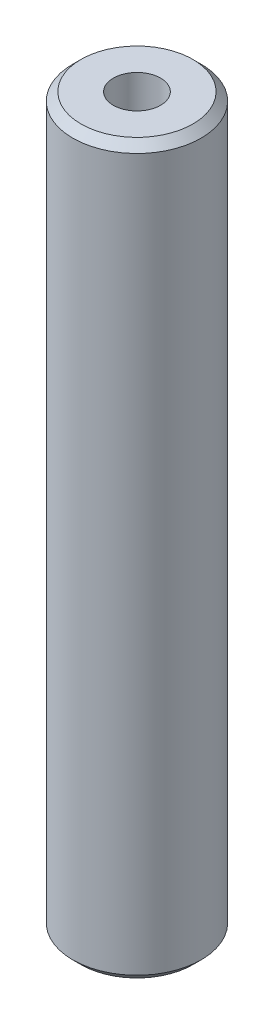
ISO-10303-21;
HEADER;
FILE_DESCRIPTION(('STEP AP214'),'2;1');
FILE_NAME('part.step','',(''),(''),'','','');
FILE_SCHEMA(('AUTOMOTIVE_DESIGN { 1 0 10303 214 1 1 1 1 }'));
ENDSEC;
DATA;
#1=APPLICATION_CONTEXT('core data for automotive mechanical design processes');
#2=APPLICATION_PROTOCOL_DEFINITION('international standard','automotive_design',2000,#1);
#3=PRODUCT_CONTEXT('',#1,'mechanical');
#4=PRODUCT('Part','Part','',(#3));
#5=PRODUCT_RELATED_PRODUCT_CATEGORY('part','',(#4));
#6=PRODUCT_DEFINITION_FORMATION('','',#4);
#7=PRODUCT_DEFINITION_CONTEXT('part definition',#1,'design');
#8=PRODUCT_DEFINITION('design','',#6,#7);
#9=PRODUCT_DEFINITION_SHAPE('','',#8);
#10=(LENGTH_UNIT() NAMED_UNIT(*) SI_UNIT(.MILLI.,.METRE.));
#11=(NAMED_UNIT(*) PLANE_ANGLE_UNIT() SI_UNIT($,.RADIAN.));
#12=(NAMED_UNIT(*) SI_UNIT($,.STERADIAN.) SOLID_ANGLE_UNIT());
#13=UNCERTAINTY_MEASURE_WITH_UNIT(LENGTH_MEASURE(1.E-05),#10,'distance_accuracy_value','');
#14=(GEOMETRIC_REPRESENTATION_CONTEXT(3) GLOBAL_UNCERTAINTY_ASSIGNED_CONTEXT((#13)) GLOBAL_UNIT_ASSIGNED_CONTEXT((#10,
#11,#12)) REPRESENTATION_CONTEXT('',''));
#15=CARTESIAN_POINT('',(0.,0.,0.));
#16=DIRECTION('',(0.,0.,1.));
#17=DIRECTION('',(1.,0.,0.));
#18=AXIS2_PLACEMENT_3D('',#15,#16,#17);
#19=CARTESIAN_POINT('',(0.,312.084448169811,0.));
#20=DIRECTION('',(0.,-1.,0.));
#21=DIRECTION('',(0.,0.,-1.));
#22=AXIS2_PLACEMENT_3D('',#19,#20,#21);
#23=CYLINDRICAL_SURFACE('',#22,27.5);
#24=CARTESIAN_POINT('',(0.,308.576239543792,0.));
#25=DIRECTION('',(0.,1.,0.));
#26=DIRECTION('',(0.,0.,1.));
#27=AXIS2_PLACEMENT_3D('',#24,#25,#26);
#28=CIRCLE('',#27,27.5);
#29=CARTESIAN_POINT('',(0.,308.576239543792,27.5));
#30=VERTEX_POINT('',#29);
#31=EDGE_CURVE('E50',#30,#30,#28,.F.);
#32=ORIENTED_EDGE('',*,*,#31,.T.);
#33=EDGE_LOOP('',(#32));
#34=FACE_BOUND('',#33,.T.);
#35=CARTESIAN_POINT('',(0.,3.50820862601886,0.));
#36=DIRECTION('',(0.,1.,0.));
#37=DIRECTION('',(0.,0.,1.));
#38=AXIS2_PLACEMENT_3D('',#35,#36,#37);
#39=CIRCLE('',#38,27.5);
#40=CARTESIAN_POINT('',(0.,3.50820862601886,27.5));
#41=VERTEX_POINT('',#40);
#42=EDGE_CURVE('E51',#41,#41,#39,.T.);
#43=ORIENTED_EDGE('',*,*,#42,.T.);
#44=EDGE_LOOP('',(#43));
#45=FACE_BOUND('',#44,.T.);
#46=ADVANCED_FACE('F39',(#34,#45),#23,.T.);
#47=CARTESIAN_POINT('',(0.,312.084448169811,0.));
#48=DIRECTION('',(0.,1.,0.));
#49=DIRECTION('',(0.,0.,1.));
#50=AXIS2_PLACEMENT_3D('',#47,#48,#49);
#51=PLANE('',#50);
#52=CARTESIAN_POINT('',(0.,312.084448169811,0.));
#53=DIRECTION('',(0.,1.,0.));
#54=DIRECTION('',(0.,0.,1.));
#55=AXIS2_PLACEMENT_3D('',#52,#53,#54);
#56=CIRCLE('',#55,23.9917913739812);
#57=CARTESIAN_POINT('',(0.,312.084448169811,23.9917913739812));
#58=VERTEX_POINT('',#57);
#59=EDGE_CURVE('E54',#58,#58,#56,.T.);
#60=ORIENTED_EDGE('',*,*,#59,.T.);
#61=EDGE_LOOP('',(#60));
#62=FACE_BOUND('',#61,.T.);
#63=CARTESIAN_POINT('',(0.,312.084448169811,0.));
#64=DIRECTION('',(0.,1.,0.));
#65=DIRECTION('',(0.,0.,1.));
#66=AXIS2_PLACEMENT_3D('',#63,#64,#65);
#67=CIRCLE('',#66,10.1255833533448);
#68=CARTESIAN_POINT('',(0.,312.084448169811,10.1255833533448));
#69=VERTEX_POINT('',#68);
#70=EDGE_CURVE('E58',#69,#69,#67,.T.);
#71=ORIENTED_EDGE('',*,*,#70,.F.);
#72=EDGE_LOOP('',(#71));
#73=FACE_BOUND('',#72,.T.);
#74=ADVANCED_FACE('F69',(#62,#73),#51,.T.);
#75=CARTESIAN_POINT('',(0.,0.,0.));
#76=DIRECTION('',(0.,1.,0.));
#77=DIRECTION('',(0.,0.,1.));
#78=AXIS2_PLACEMENT_3D('',#75,#76,#77);
#79=PLANE('',#78);
#80=CARTESIAN_POINT('',(0.,0.,0.));
#81=DIRECTION('',(0.,1.,0.));
#82=DIRECTION('',(0.,0.,1.));
#83=AXIS2_PLACEMENT_3D('',#80,#81,#82);
#84=CIRCLE('',#83,23.9917913739811);
#85=CARTESIAN_POINT('',(0.,0.,23.9917913739811));
#86=VERTEX_POINT('',#85);
#87=EDGE_CURVE('E10',#86,#86,#84,.F.);
#88=ORIENTED_EDGE('',*,*,#87,.T.);
#89=EDGE_LOOP('',(#88));
#90=FACE_BOUND('',#89,.T.);
#91=CARTESIAN_POINT('',(0.,0.,0.));
#92=DIRECTION('',(0.,1.,0.));
#93=DIRECTION('',(0.,0.,1.));
#94=AXIS2_PLACEMENT_3D('',#91,#92,#93);
#95=CIRCLE('',#94,10.1255833533448);
#96=CARTESIAN_POINT('',(0.,0.,10.1255833533448));
#97=VERTEX_POINT('',#96);
#98=EDGE_CURVE('E63',#97,#97,#95,.T.);
#99=ORIENTED_EDGE('',*,*,#98,.T.);
#100=EDGE_LOOP('',(#99));
#101=FACE_BOUND('',#100,.T.);
#102=ADVANCED_FACE('F75',(#90,#101),#79,.F.);
#103=CARTESIAN_POINT('',(0.,312.084448169811,0.));
#104=DIRECTION('',(0.,-1.,0.));
#105=DIRECTION('',(0.,0.,-1.));
#106=AXIS2_PLACEMENT_3D('',#103,#104,#105);
#107=CYLINDRICAL_SURFACE('',#106,10.1255833533448);
#108=ORIENTED_EDGE('',*,*,#70,.T.);
#109=EDGE_LOOP('',(#108));
#110=FACE_BOUND('',#109,.T.);
#111=ORIENTED_EDGE('',*,*,#98,.F.);
#112=EDGE_LOOP('',(#111));
#113=FACE_BOUND('',#112,.T.);
#114=ADVANCED_FACE('F70',(#110,#113),#107,.F.);
#115=CARTESIAN_POINT('',(0.,312.084448169811,0.));
#116=DIRECTION('',(0.,-1.,0.));
#117=DIRECTION('',(0.,0.,-1.));
#118=AXIS2_PLACEMENT_3D('',#115,#116,#117);
#119=CONICAL_SURFACE('',#118,23.9917913739812,0.785398163397445);
#120=ORIENTED_EDGE('',*,*,#31,.F.);
#121=EDGE_LOOP('',(#120));
#122=FACE_BOUND('',#121,.T.);
#123=ORIENTED_EDGE('',*,*,#59,.F.);
#124=EDGE_LOOP('',(#123));
#125=FACE_BOUND('',#124,.T.);
#126=ADVANCED_FACE('F81',(#122,#125),#119,.T.);
#127=CARTESIAN_POINT('',(0.,3.50820862601886,0.));
#128=DIRECTION('',(0.,1.,0.));
#129=DIRECTION('',(0.,0.,1.));
#130=AXIS2_PLACEMENT_3D('',#127,#128,#129);
#131=CONICAL_SURFACE('',#130,27.5,0.785398163397453);
#132=ORIENTED_EDGE('',*,*,#87,.F.);
#133=EDGE_LOOP('',(#132));
#134=FACE_BOUND('',#133,.T.);
#135=ORIENTED_EDGE('',*,*,#42,.F.);
#136=EDGE_LOOP('',(#135));
#137=FACE_BOUND('',#136,.T.);
#138=ADVANCED_FACE('F45',(#134,#137),#131,.T.);
#139=CLOSED_SHELL('',(#46,#74,#102,#114,#126,#138));
#140=MANIFOLD_SOLID_BREP('B2',#139);
#141=ADVANCED_BREP_SHAPE_REPRESENTATION('',(#18,#140),#14);
#142=SHAPE_DEFINITION_REPRESENTATION(#9,#141);
ENDSEC;
END-ISO-10303-21;
